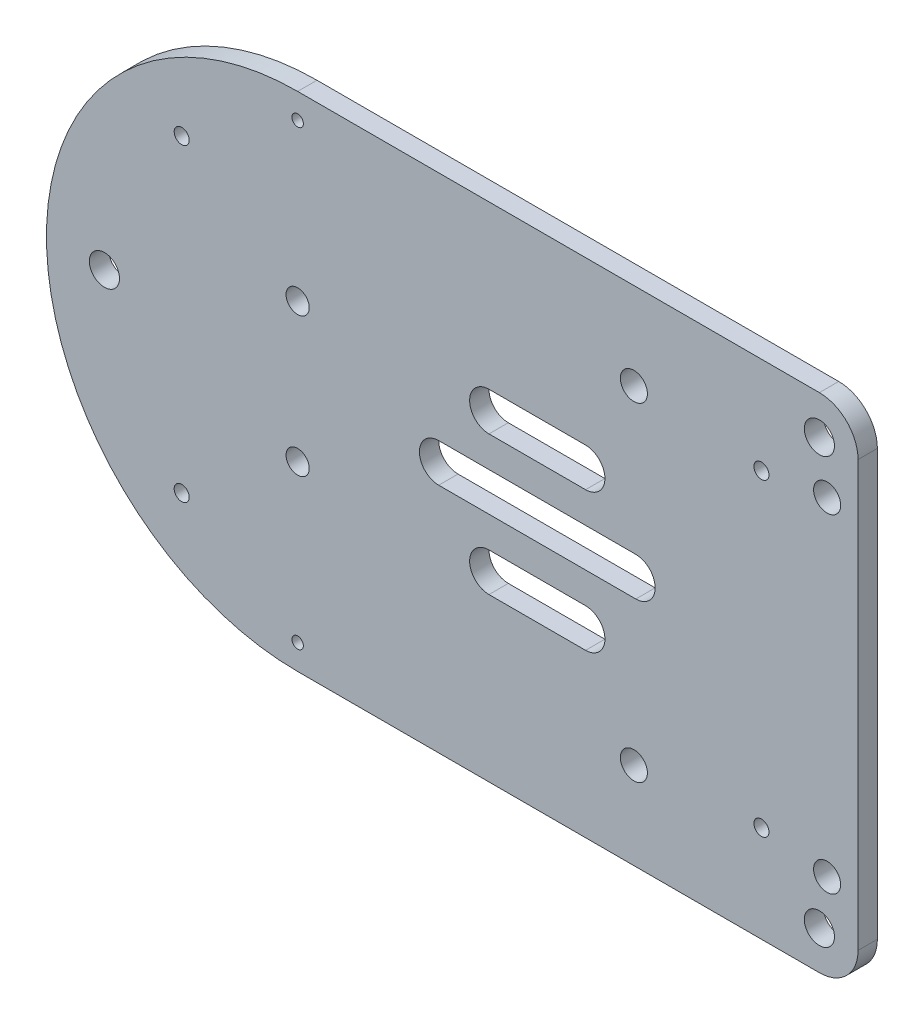
ISO-10303-21;
HEADER;
FILE_DESCRIPTION(('STEP AP214'),'2;1');
FILE_NAME('part.step','',(''),(''),'','','');
FILE_SCHEMA(('AUTOMOTIVE_DESIGN { 1 0 10303 214 1 1 1 1 }'));
ENDSEC;
DATA;
#1=APPLICATION_CONTEXT('core data for automotive mechanical design processes');
#2=APPLICATION_PROTOCOL_DEFINITION('international standard','automotive_design',2000,#1);
#3=PRODUCT_CONTEXT('',#1,'mechanical');
#4=PRODUCT('Part','Part','',(#3));
#5=PRODUCT_RELATED_PRODUCT_CATEGORY('part','',(#4));
#6=PRODUCT_DEFINITION_FORMATION('','',#4);
#7=PRODUCT_DEFINITION_CONTEXT('part definition',#1,'design');
#8=PRODUCT_DEFINITION('design','',#6,#7);
#9=PRODUCT_DEFINITION_SHAPE('','',#8);
#10=(LENGTH_UNIT() NAMED_UNIT(*) SI_UNIT(.MILLI.,.METRE.));
#11=(NAMED_UNIT(*) PLANE_ANGLE_UNIT() SI_UNIT($,.RADIAN.));
#12=(NAMED_UNIT(*) SI_UNIT($,.STERADIAN.) SOLID_ANGLE_UNIT());
#13=UNCERTAINTY_MEASURE_WITH_UNIT(LENGTH_MEASURE(1.E-05),#10,'distance_accuracy_value','');
#14=(GEOMETRIC_REPRESENTATION_CONTEXT(3) GLOBAL_UNCERTAINTY_ASSIGNED_CONTEXT((#13)) GLOBAL_UNIT_ASSIGNED_CONTEXT((#10,
#11,#12)) REPRESENTATION_CONTEXT('',''));
#15=CARTESIAN_POINT('',(0.,0.,0.));
#16=DIRECTION('',(0.,0.,1.));
#17=DIRECTION('',(1.,0.,0.));
#18=AXIS2_PLACEMENT_3D('',#15,#16,#17);
#19=CARTESIAN_POINT('',(-40.,0.,5.));
#20=DIRECTION('',(0.,0.,1.));
#21=DIRECTION('',(1.,0.,0.));
#22=AXIS2_PLACEMENT_3D('',#19,#20,#21);
#23=PLANE('',#22);
#24=CARTESIAN_POINT('',(-40.,58.5,5.));
#25=DIRECTION('',(0.,0.,1.));
#26=DIRECTION('',(1.,0.,0.));
#27=AXIS2_PLACEMENT_3D('',#24,#25,#26);
#28=CIRCLE('',#27,1.475);
#29=CARTESIAN_POINT('',(-38.525,58.5,5.));
#30=VERTEX_POINT('',#29);
#31=EDGE_CURVE('E186',#30,#30,#28,.T.);
#32=ORIENTED_EDGE('',*,*,#31,.F.);
#33=EDGE_LOOP('',(#32));
#34=FACE_BOUND('',#33,.T.);
#35=CARTESIAN_POINT('',(97.,-42.5,5.));
#36=DIRECTION('',(0.,0.,1.));
#37=DIRECTION('',(-1.,0.,0.));
#38=AXIS2_PLACEMENT_3D('',#35,#36,#37);
#39=CIRCLE('',#38,3.50000000000001);
#40=CARTESIAN_POINT('',(93.5,-42.5,5.));
#41=VERTEX_POINT('',#40);
#42=EDGE_CURVE('E233',#41,#41,#39,.T.);
#43=ORIENTED_EDGE('',*,*,#42,.F.);
#44=EDGE_LOOP('',(#43));
#45=FACE_BOUND('',#44,.T.);
#46=CARTESIAN_POINT('',(47.,42.5,5.));
#47=DIRECTION('',(0.,0.,1.));
#48=DIRECTION('',(1.,0.,0.));
#49=AXIS2_PLACEMENT_3D('',#46,#47,#48);
#50=CIRCLE('',#49,3.5);
#51=CARTESIAN_POINT('',(50.5,42.5,5.));
#52=VERTEX_POINT('',#51);
#53=EDGE_CURVE('E276',#52,#52,#50,.T.);
#54=ORIENTED_EDGE('',*,*,#53,.F.);
#55=EDGE_LOOP('',(#54));
#56=FACE_BOUND('',#55,.T.);
#57=CARTESIAN_POINT('',(-70.,40.,5.));
#58=DIRECTION('',(0.,0.,1.));
#59=DIRECTION('',(1.,0.,0.));
#60=AXIS2_PLACEMENT_3D('',#57,#58,#59);
#61=CIRCLE('',#60,1.95);
#62=CARTESIAN_POINT('',(-68.05,40.,5.));
#63=VERTEX_POINT('',#62);
#64=EDGE_CURVE('E288',#63,#63,#61,.T.);
#65=ORIENTED_EDGE('',*,*,#64,.F.);
#66=EDGE_LOOP('',(#65));
#67=FACE_BOUND('',#66,.T.);
#68=CARTESIAN_POINT('',(80.,40.,5.));
#69=DIRECTION('',(0.,0.,1.));
#70=DIRECTION('',(1.,0.,0.));
#71=AXIS2_PLACEMENT_3D('',#68,#69,#70);
#72=CIRCLE('',#71,1.95);
#73=CARTESIAN_POINT('',(81.95,40.,5.));
#74=VERTEX_POINT('',#73);
#75=EDGE_CURVE('E300',#74,#74,#72,.T.);
#76=ORIENTED_EDGE('',*,*,#75,.F.);
#77=EDGE_LOOP('',(#76));
#78=FACE_BOUND('',#77,.T.);
#79=CARTESIAN_POINT('',(-40.,18.,5.));
#80=DIRECTION('',(0.,0.,1.));
#81=DIRECTION('',(1.,0.,0.));
#82=AXIS2_PLACEMENT_3D('',#79,#80,#81);
#83=CIRCLE('',#82,3.);
#84=CARTESIAN_POINT('',(-37.,18.,5.));
#85=VERTEX_POINT('',#84);
#86=EDGE_CURVE('E312',#85,#85,#83,.T.);
#87=ORIENTED_EDGE('',*,*,#86,.F.);
#88=EDGE_LOOP('',(#87));
#89=FACE_BOUND('',#88,.T.);
#90=CARTESIAN_POINT('',(95.,55.,5.));
#91=DIRECTION('',(0.,0.,1.));
#92=DIRECTION('',(1.,0.,0.));
#93=AXIS2_PLACEMENT_3D('',#90,#91,#92);
#94=CIRCLE('',#93,3.9);
#95=CARTESIAN_POINT('',(98.9,55.,5.));
#96=VERTEX_POINT('',#95);
#97=EDGE_CURVE('E324',#96,#96,#94,.T.);
#98=ORIENTED_EDGE('',*,*,#97,.F.);
#99=EDGE_LOOP('',(#98));
#100=FACE_BOUND('',#99,.T.);
#101=CARTESIAN_POINT('',(-40.,0.,5.));
#102=DIRECTION('',(0.,0.,1.));
#103=DIRECTION('',(1.,0.,0.));
#104=AXIS2_PLACEMENT_3D('',#101,#102,#103);
#105=CIRCLE('',#104,65.);
#106=CARTESIAN_POINT('',(-40.,65.,5.));
#107=VERTEX_POINT('',#106);
#108=CARTESIAN_POINT('',(-40.,-65.,5.));
#109=VERTEX_POINT('',#108);
#110=EDGE_CURVE('E336',#107,#109,#105,.T.);
#111=ORIENTED_EDGE('',*,*,#110,.T.);
#112=DIRECTION('',(1.,0.,0.));
#113=VECTOR('',#112,1.);
#114=CARTESIAN_POINT('',(-40.,-65.,5.));
#115=LINE('',#114,#113);
#116=CARTESIAN_POINT('',(94.9999999999999,-65.,5.));
#117=VERTEX_POINT('',#116);
#118=EDGE_CURVE('E339',#109,#117,#115,.T.);
#119=ORIENTED_EDGE('',*,*,#118,.T.);
#120=CARTESIAN_POINT('',(95.,-55.,5.));
#121=DIRECTION('',(0.,0.,1.));
#122=DIRECTION('',(1.,0.,0.));
#123=AXIS2_PLACEMENT_3D('',#120,#121,#122);
#124=CIRCLE('',#123,10.);
#125=CARTESIAN_POINT('',(105.,-54.9999999999999,5.));
#126=VERTEX_POINT('',#125);
#127=EDGE_CURVE('E342',#117,#126,#124,.T.);
#128=ORIENTED_EDGE('',*,*,#127,.T.);
#129=DIRECTION('',(0.,1.,0.));
#130=VECTOR('',#129,1.);
#131=CARTESIAN_POINT('',(105.,54.9999999999999,5.));
#132=LINE('',#131,#130);
#133=CARTESIAN_POINT('',(105.,54.9999999999999,5.));
#134=VERTEX_POINT('',#133);
#135=EDGE_CURVE('E344',#126,#134,#132,.T.);
#136=ORIENTED_EDGE('',*,*,#135,.T.);
#137=CARTESIAN_POINT('',(95.,55.,5.));
#138=DIRECTION('',(0.,0.,1.));
#139=DIRECTION('',(-1.,0.,0.));
#140=AXIS2_PLACEMENT_3D('',#137,#138,#139);
#141=CIRCLE('',#140,10.);
#142=CARTESIAN_POINT('',(94.9999999999999,65.,5.));
#143=VERTEX_POINT('',#142);
#144=EDGE_CURVE('E346',#134,#143,#141,.T.);
#145=ORIENTED_EDGE('',*,*,#144,.T.);
#146=DIRECTION('',(-1.,0.,0.));
#147=VECTOR('',#146,1.);
#148=CARTESIAN_POINT('',(-40.,65.,5.));
#149=LINE('',#148,#147);
#150=EDGE_CURVE('E348',#143,#107,#149,.T.);
#151=ORIENTED_EDGE('',*,*,#150,.T.);
#152=EDGE_LOOP('',(#111,#119,#128,#136,#145,#151));
#153=FACE_BOUND('',#152,.T.);
#154=CARTESIAN_POINT('',(-90.,0.,5.));
#155=DIRECTION('',(0.,0.,1.));
#156=DIRECTION('',(1.,0.,0.));
#157=AXIS2_PLACEMENT_3D('',#154,#155,#156);
#158=CIRCLE('',#157,3.9);
#159=CARTESIAN_POINT('',(-86.1,0.,5.));
#160=VERTEX_POINT('',#159);
#161=EDGE_CURVE('E330',#160,#160,#158,.T.);
#162=ORIENTED_EDGE('',*,*,#161,.F.);
#163=EDGE_LOOP('',(#162));
#164=FACE_BOUND('',#163,.T.);
#165=CARTESIAN_POINT('',(95.,-55.,5.));
#166=DIRECTION('',(0.,0.,1.));
#167=DIRECTION('',(-1.,0.,0.));
#168=AXIS2_PLACEMENT_3D('',#165,#166,#167);
#169=CIRCLE('',#168,3.9);
#170=CARTESIAN_POINT('',(91.1,-55.,5.));
#171=VERTEX_POINT('',#170);
#172=EDGE_CURVE('E318',#171,#171,#169,.T.);
#173=ORIENTED_EDGE('',*,*,#172,.F.);
#174=EDGE_LOOP('',(#173));
#175=FACE_BOUND('',#174,.T.);
#176=CARTESIAN_POINT('',(-40.,-18.,5.));
#177=DIRECTION('',(0.,0.,1.));
#178=DIRECTION('',(-1.,0.,0.));
#179=AXIS2_PLACEMENT_3D('',#176,#177,#178);
#180=CIRCLE('',#179,3.);
#181=CARTESIAN_POINT('',(-43.,-18.,5.));
#182=VERTEX_POINT('',#181);
#183=EDGE_CURVE('E306',#182,#182,#180,.T.);
#184=ORIENTED_EDGE('',*,*,#183,.F.);
#185=EDGE_LOOP('',(#184));
#186=FACE_BOUND('',#185,.T.);
#187=CARTESIAN_POINT('',(80.,-40.,5.));
#188=DIRECTION('',(0.,0.,1.));
#189=DIRECTION('',(-1.,0.,0.));
#190=AXIS2_PLACEMENT_3D('',#187,#188,#189);
#191=CIRCLE('',#190,1.95);
#192=CARTESIAN_POINT('',(78.05,-40.,5.));
#193=VERTEX_POINT('',#192);
#194=EDGE_CURVE('E294',#193,#193,#191,.T.);
#195=ORIENTED_EDGE('',*,*,#194,.F.);
#196=EDGE_LOOP('',(#195));
#197=FACE_BOUND('',#196,.T.);
#198=CARTESIAN_POINT('',(-70.,-40.,5.));
#199=DIRECTION('',(0.,0.,1.));
#200=DIRECTION('',(-1.,0.,0.));
#201=AXIS2_PLACEMENT_3D('',#198,#199,#200);
#202=CIRCLE('',#201,1.95);
#203=CARTESIAN_POINT('',(-71.95,-40.,5.));
#204=VERTEX_POINT('',#203);
#205=EDGE_CURVE('E282',#204,#204,#202,.T.);
#206=ORIENTED_EDGE('',*,*,#205,.F.);
#207=EDGE_LOOP('',(#206));
#208=FACE_BOUND('',#207,.T.);
#209=CARTESIAN_POINT('',(97.,42.5,5.));
#210=DIRECTION('',(0.,0.,1.));
#211=DIRECTION('',(1.,0.,0.));
#212=AXIS2_PLACEMENT_3D('',#209,#210,#211);
#213=CIRCLE('',#212,3.50000000000001);
#214=CARTESIAN_POINT('',(100.5,42.5,5.));
#215=VERTEX_POINT('',#214);
#216=EDGE_CURVE('E270',#215,#215,#213,.T.);
#217=ORIENTED_EDGE('',*,*,#216,.F.);
#218=EDGE_LOOP('',(#217));
#219=FACE_BOUND('',#218,.T.);
#220=DIRECTION('',(1.,0.,0.));
#221=VECTOR('',#220,1.);
#222=CARTESIAN_POINT('',(-3.49999999999998,-5.,5.));
#223=LINE('',#222,#221);
#224=CARTESIAN_POINT('',(-3.49999999999998,-5.,5.));
#225=VERTEX_POINT('',#224);
#226=CARTESIAN_POINT('',(47.5,-5.,5.));
#227=VERTEX_POINT('',#226);
#228=EDGE_CURVE('E241',#225,#227,#223,.T.);
#229=ORIENTED_EDGE('',*,*,#228,.F.);
#230=CARTESIAN_POINT('',(-3.49999999999998,0.,5.));
#231=DIRECTION('',(0.,0.,1.));
#232=DIRECTION('',(1.,0.,0.));
#233=AXIS2_PLACEMENT_3D('',#230,#231,#232);
#234=CIRCLE('',#233,5.);
#235=CARTESIAN_POINT('',(-3.49999999999998,5.,5.));
#236=VERTEX_POINT('',#235);
#237=EDGE_CURVE('E239',#236,#225,#234,.T.);
#238=ORIENTED_EDGE('',*,*,#237,.F.);
#239=DIRECTION('',(-1.,0.,0.));
#240=VECTOR('',#239,1.);
#241=CARTESIAN_POINT('',(-3.49999999999998,5.,5.));
#242=LINE('',#241,#240);
#243=CARTESIAN_POINT('',(47.5,5.,5.));
#244=VERTEX_POINT('',#243);
#245=EDGE_CURVE('E247',#244,#236,#242,.T.);
#246=ORIENTED_EDGE('',*,*,#245,.F.);
#247=CARTESIAN_POINT('',(47.5,0.,5.));
#248=DIRECTION('',(0.,0.,1.));
#249=DIRECTION('',(1.,0.,0.));
#250=AXIS2_PLACEMENT_3D('',#247,#248,#249);
#251=CIRCLE('',#250,5.);
#252=EDGE_CURVE('E244',#227,#244,#251,.T.);
#253=ORIENTED_EDGE('',*,*,#252,.F.);
#254=EDGE_LOOP('',(#229,#238,#246,#253));
#255=FACE_BOUND('',#254,.T.);
#256=CARTESIAN_POINT('',(47.,-42.5,5.));
#257=DIRECTION('',(0.,0.,1.));
#258=DIRECTION('',(-1.,0.,0.));
#259=AXIS2_PLACEMENT_3D('',#256,#257,#258);
#260=CIRCLE('',#259,3.5);
#261=CARTESIAN_POINT('',(43.5,-42.5,5.));
#262=VERTEX_POINT('',#261);
#263=EDGE_CURVE('E227',#262,#262,#260,.T.);
#264=ORIENTED_EDGE('',*,*,#263,.F.);
#265=EDGE_LOOP('',(#264));
#266=FACE_BOUND('',#265,.T.);
#267=DIRECTION('',(1.,0.,0.));
#268=VECTOR('',#267,1.);
#269=CARTESIAN_POINT('',(9.50000000000002,13.,5.));
#270=LINE('',#269,#268);
#271=CARTESIAN_POINT('',(9.50000000000002,13.,5.));
#272=VERTEX_POINT('',#271);
#273=CARTESIAN_POINT('',(34.5,13.,5.));
#274=VERTEX_POINT('',#273);
#275=EDGE_CURVE('E198',#272,#274,#270,.T.);
#276=ORIENTED_EDGE('',*,*,#275,.F.);
#277=CARTESIAN_POINT('',(9.50000000000002,18.,5.));
#278=DIRECTION('',(0.,0.,1.));
#279=DIRECTION('',(1.,0.,0.));
#280=AXIS2_PLACEMENT_3D('',#277,#278,#279);
#281=CIRCLE('',#280,5.);
#282=CARTESIAN_POINT('',(9.50000000000002,23.,5.));
#283=VERTEX_POINT('',#282);
#284=EDGE_CURVE('E196',#283,#272,#281,.T.);
#285=ORIENTED_EDGE('',*,*,#284,.F.);
#286=DIRECTION('',(-1.,0.,0.));
#287=VECTOR('',#286,1.);
#288=CARTESIAN_POINT('',(9.50000000000002,23.,5.));
#289=LINE('',#288,#287);
#290=CARTESIAN_POINT('',(34.5,23.,5.));
#291=VERTEX_POINT('',#290);
#292=EDGE_CURVE('E204',#291,#283,#289,.T.);
#293=ORIENTED_EDGE('',*,*,#292,.F.);
#294=CARTESIAN_POINT('',(34.5,18.,5.));
#295=DIRECTION('',(0.,0.,1.));
#296=DIRECTION('',(1.,0.,0.));
#297=AXIS2_PLACEMENT_3D('',#294,#295,#296);
#298=CIRCLE('',#297,5.);
#299=EDGE_CURVE('E201',#274,#291,#298,.T.);
#300=ORIENTED_EDGE('',*,*,#299,.F.);
#301=EDGE_LOOP('',(#276,#285,#293,#300));
#302=FACE_BOUND('',#301,.T.);
#303=DIRECTION('',(1.,0.,0.));
#304=VECTOR('',#303,1.);
#305=CARTESIAN_POINT('',(9.50000000000002,-23.,5.));
#306=LINE('',#305,#304);
#307=CARTESIAN_POINT('',(9.50000000000002,-23.,5.));
#308=VERTEX_POINT('',#307);
#309=CARTESIAN_POINT('',(34.5,-23.,5.));
#310=VERTEX_POINT('',#309);
#311=EDGE_CURVE('E165',#308,#310,#306,.T.);
#312=ORIENTED_EDGE('',*,*,#311,.F.);
#313=CARTESIAN_POINT('',(9.50000000000002,-18.,5.));
#314=DIRECTION('',(0.,0.,1.));
#315=DIRECTION('',(-1.,0.,0.));
#316=AXIS2_PLACEMENT_3D('',#313,#314,#315);
#317=CIRCLE('',#316,5.);
#318=CARTESIAN_POINT('',(9.50000000000002,-13.,5.));
#319=VERTEX_POINT('',#318);
#320=EDGE_CURVE('E157',#319,#308,#317,.T.);
#321=ORIENTED_EDGE('',*,*,#320,.F.);
#322=DIRECTION('',(-1.,0.,0.));
#323=VECTOR('',#322,1.);
#324=CARTESIAN_POINT('',(9.50000000000002,-13.,5.));
#325=LINE('',#324,#323);
#326=CARTESIAN_POINT('',(34.5,-13.,5.));
#327=VERTEX_POINT('',#326);
#328=EDGE_CURVE('E180',#327,#319,#325,.T.);
#329=ORIENTED_EDGE('',*,*,#328,.F.);
#330=CARTESIAN_POINT('',(34.5,-18.,5.));
#331=DIRECTION('',(0.,0.,1.));
#332=DIRECTION('',(-1.,0.,0.));
#333=AXIS2_PLACEMENT_3D('',#330,#331,#332);
#334=CIRCLE('',#333,5.);
#335=EDGE_CURVE('E178',#310,#327,#334,.T.);
#336=ORIENTED_EDGE('',*,*,#335,.F.);
#337=EDGE_LOOP('',(#312,#321,#329,#336));
#338=FACE_BOUND('',#337,.T.);
#339=CARTESIAN_POINT('',(-40.,-58.5,5.));
#340=DIRECTION('',(0.,0.,1.));
#341=DIRECTION('',(-1.,0.,0.));
#342=AXIS2_PLACEMENT_3D('',#339,#340,#341);
#343=CIRCLE('',#342,1.475);
#344=CARTESIAN_POINT('',(-41.475,-58.5,5.));
#345=VERTEX_POINT('',#344);
#346=EDGE_CURVE('E529',#345,#345,#343,.T.);
#347=ORIENTED_EDGE('',*,*,#346,.F.);
#348=EDGE_LOOP('',(#347));
#349=FACE_BOUND('',#348,.T.);
#350=ADVANCED_FACE('F32',(#34,#45,#56,#67,#78,#89,#100,#153,#164,#175,#186,#197,#208,#219,#255,
#266,#302,#338,#349),#23,.T.);
#351=CARTESIAN_POINT('',(-40.,0.,0.));
#352=DIRECTION('',(0.,0.,1.));
#353=DIRECTION('',(1.,0.,0.));
#354=AXIS2_PLACEMENT_3D('',#351,#352,#353);
#355=PLANE('',#354);
#356=CARTESIAN_POINT('',(9.50000000000002,18.,0.));
#357=DIRECTION('',(0.,0.,1.));
#358=DIRECTION('',(1.,0.,0.));
#359=AXIS2_PLACEMENT_3D('',#356,#357,#358);
#360=CIRCLE('',#359,5.);
#361=CARTESIAN_POINT('',(9.50000000000002,23.,0.));
#362=VERTEX_POINT('',#361);
#363=CARTESIAN_POINT('',(9.50000000000002,13.,0.));
#364=VERTEX_POINT('',#363);
#365=EDGE_CURVE('E173',#362,#364,#360,.T.);
#366=ORIENTED_EDGE('',*,*,#365,.T.);
#367=DIRECTION('',(1.,0.,0.));
#368=VECTOR('',#367,1.);
#369=CARTESIAN_POINT('',(9.50000000000002,13.,0.));
#370=LINE('',#369,#368);
#371=CARTESIAN_POINT('',(34.5,13.,0.));
#372=VERTEX_POINT('',#371);
#373=EDGE_CURVE('E209',#364,#372,#370,.T.);
#374=ORIENTED_EDGE('',*,*,#373,.T.);
#375=CARTESIAN_POINT('',(34.5,18.,0.));
#376=DIRECTION('',(0.,0.,1.));
#377=DIRECTION('',(1.,0.,0.));
#378=AXIS2_PLACEMENT_3D('',#375,#376,#377);
#379=CIRCLE('',#378,5.);
#380=CARTESIAN_POINT('',(34.5,23.,0.));
#381=VERTEX_POINT('',#380);
#382=EDGE_CURVE('E212',#372,#381,#379,.T.);
#383=ORIENTED_EDGE('',*,*,#382,.T.);
#384=DIRECTION('',(-1.,0.,0.));
#385=VECTOR('',#384,1.);
#386=CARTESIAN_POINT('',(9.50000000000002,23.,0.));
#387=LINE('',#386,#385);
#388=EDGE_CURVE('E199',#381,#362,#387,.T.);
#389=ORIENTED_EDGE('',*,*,#388,.T.);
#390=EDGE_LOOP('',(#366,#374,#383,#389));
#391=FACE_BOUND('',#390,.T.);
#392=CARTESIAN_POINT('',(97.,42.5,0.));
#393=DIRECTION('',(0.,0.,1.));
#394=DIRECTION('',(1.,0.,0.));
#395=AXIS2_PLACEMENT_3D('',#392,#393,#394);
#396=CIRCLE('',#395,3.50000000000001);
#397=CARTESIAN_POINT('',(100.5,42.5,0.));
#398=VERTEX_POINT('',#397);
#399=EDGE_CURVE('E269',#398,#398,#396,.T.);
#400=ORIENTED_EDGE('',*,*,#399,.T.);
#401=EDGE_LOOP('',(#400));
#402=FACE_BOUND('',#401,.T.);
#403=CARTESIAN_POINT('',(47.,42.5,0.));
#404=DIRECTION('',(0.,0.,1.));
#405=DIRECTION('',(1.,0.,0.));
#406=AXIS2_PLACEMENT_3D('',#403,#404,#405);
#407=CIRCLE('',#406,3.5);
#408=CARTESIAN_POINT('',(50.5,42.5,0.));
#409=VERTEX_POINT('',#408);
#410=EDGE_CURVE('E273',#409,#409,#407,.T.);
#411=ORIENTED_EDGE('',*,*,#410,.T.);
#412=EDGE_LOOP('',(#411));
#413=FACE_BOUND('',#412,.T.);
#414=CARTESIAN_POINT('',(-70.,-40.,0.));
#415=DIRECTION('',(0.,0.,1.));
#416=DIRECTION('',(-1.,0.,0.));
#417=AXIS2_PLACEMENT_3D('',#414,#415,#416);
#418=CIRCLE('',#417,1.95);
#419=CARTESIAN_POINT('',(-71.95,-40.,0.));
#420=VERTEX_POINT('',#419);
#421=EDGE_CURVE('E279',#420,#420,#418,.T.);
#422=ORIENTED_EDGE('',*,*,#421,.T.);
#423=EDGE_LOOP('',(#422));
#424=FACE_BOUND('',#423,.T.);
#425=CARTESIAN_POINT('',(-70.,40.,0.));
#426=DIRECTION('',(0.,0.,1.));
#427=DIRECTION('',(1.,0.,0.));
#428=AXIS2_PLACEMENT_3D('',#425,#426,#427);
#429=CIRCLE('',#428,1.95);
#430=CARTESIAN_POINT('',(-68.05,40.,0.));
#431=VERTEX_POINT('',#430);
#432=EDGE_CURVE('E285',#431,#431,#429,.T.);
#433=ORIENTED_EDGE('',*,*,#432,.T.);
#434=EDGE_LOOP('',(#433));
#435=FACE_BOUND('',#434,.T.);
#436=CARTESIAN_POINT('',(80.,-40.,0.));
#437=DIRECTION('',(0.,0.,1.));
#438=DIRECTION('',(-1.,0.,0.));
#439=AXIS2_PLACEMENT_3D('',#436,#437,#438);
#440=CIRCLE('',#439,1.95);
#441=CARTESIAN_POINT('',(78.05,-40.,0.));
#442=VERTEX_POINT('',#441);
#443=EDGE_CURVE('E291',#442,#442,#440,.T.);
#444=ORIENTED_EDGE('',*,*,#443,.T.);
#445=EDGE_LOOP('',(#444));
#446=FACE_BOUND('',#445,.T.);
#447=CARTESIAN_POINT('',(80.,40.,0.));
#448=DIRECTION('',(0.,0.,1.));
#449=DIRECTION('',(1.,0.,0.));
#450=AXIS2_PLACEMENT_3D('',#447,#448,#449);
#451=CIRCLE('',#450,1.95);
#452=CARTESIAN_POINT('',(81.95,40.,0.));
#453=VERTEX_POINT('',#452);
#454=EDGE_CURVE('E297',#453,#453,#451,.T.);
#455=ORIENTED_EDGE('',*,*,#454,.T.);
#456=EDGE_LOOP('',(#455));
#457=FACE_BOUND('',#456,.T.);
#458=CARTESIAN_POINT('',(-40.,-18.,0.));
#459=DIRECTION('',(0.,0.,1.));
#460=DIRECTION('',(-1.,0.,0.));
#461=AXIS2_PLACEMENT_3D('',#458,#459,#460);
#462=CIRCLE('',#461,3.);
#463=CARTESIAN_POINT('',(-43.,-18.,0.));
#464=VERTEX_POINT('',#463);
#465=EDGE_CURVE('E303',#464,#464,#462,.T.);
#466=ORIENTED_EDGE('',*,*,#465,.T.);
#467=EDGE_LOOP('',(#466));
#468=FACE_BOUND('',#467,.T.);
#469=CARTESIAN_POINT('',(-40.,18.,0.));
#470=DIRECTION('',(0.,0.,1.));
#471=DIRECTION('',(1.,0.,0.));
#472=AXIS2_PLACEMENT_3D('',#469,#470,#471);
#473=CIRCLE('',#472,3.);
#474=CARTESIAN_POINT('',(-37.,18.,0.));
#475=VERTEX_POINT('',#474);
#476=EDGE_CURVE('E309',#475,#475,#473,.T.);
#477=ORIENTED_EDGE('',*,*,#476,.T.);
#478=EDGE_LOOP('',(#477));
#479=FACE_BOUND('',#478,.T.);
#480=CARTESIAN_POINT('',(95.,-55.,0.));
#481=DIRECTION('',(0.,0.,1.));
#482=DIRECTION('',(-1.,0.,0.));
#483=AXIS2_PLACEMENT_3D('',#480,#481,#482);
#484=CIRCLE('',#483,3.9);
#485=CARTESIAN_POINT('',(91.1,-55.,0.));
#486=VERTEX_POINT('',#485);
#487=EDGE_CURVE('E315',#486,#486,#484,.T.);
#488=ORIENTED_EDGE('',*,*,#487,.T.);
#489=EDGE_LOOP('',(#488));
#490=FACE_BOUND('',#489,.T.);
#491=CARTESIAN_POINT('',(95.,55.,0.));
#492=DIRECTION('',(0.,0.,1.));
#493=DIRECTION('',(1.,0.,0.));
#494=AXIS2_PLACEMENT_3D('',#491,#492,#493);
#495=CIRCLE('',#494,3.9);
#496=CARTESIAN_POINT('',(98.9,55.,0.));
#497=VERTEX_POINT('',#496);
#498=EDGE_CURVE('E321',#497,#497,#495,.T.);
#499=ORIENTED_EDGE('',*,*,#498,.T.);
#500=EDGE_LOOP('',(#499));
#501=FACE_BOUND('',#500,.T.);
#502=CARTESIAN_POINT('',(-90.,0.,0.));
#503=DIRECTION('',(0.,0.,1.));
#504=DIRECTION('',(1.,0.,0.));
#505=AXIS2_PLACEMENT_3D('',#502,#503,#504);
#506=CIRCLE('',#505,3.9);
#507=CARTESIAN_POINT('',(-86.1,0.,0.));
#508=VERTEX_POINT('',#507);
#509=EDGE_CURVE('E327',#508,#508,#506,.T.);
#510=ORIENTED_EDGE('',*,*,#509,.T.);
#511=EDGE_LOOP('',(#510));
#512=FACE_BOUND('',#511,.T.);
#513=CARTESIAN_POINT('',(-40.,0.,0.));
#514=DIRECTION('',(0.,0.,1.));
#515=DIRECTION('',(1.,0.,0.));
#516=AXIS2_PLACEMENT_3D('',#513,#514,#515);
#517=CIRCLE('',#516,65.);
#518=CARTESIAN_POINT('',(-40.,65.,0.));
#519=VERTEX_POINT('',#518);
#520=CARTESIAN_POINT('',(-40.,-65.,0.));
#521=VERTEX_POINT('',#520);
#522=EDGE_CURVE('E333',#519,#521,#517,.T.);
#523=ORIENTED_EDGE('',*,*,#522,.F.);
#524=DIRECTION('',(-1.,0.,0.));
#525=VECTOR('',#524,1.);
#526=CARTESIAN_POINT('',(-40.,65.,0.));
#527=LINE('',#526,#525);
#528=CARTESIAN_POINT('',(94.9999999999999,65.,0.));
#529=VERTEX_POINT('',#528);
#530=EDGE_CURVE('E340',#529,#519,#527,.T.);
#531=ORIENTED_EDGE('',*,*,#530,.F.);
#532=CARTESIAN_POINT('',(95.,55.,0.));
#533=DIRECTION('',(0.,0.,1.));
#534=DIRECTION('',(-1.,0.,0.));
#535=AXIS2_PLACEMENT_3D('',#532,#533,#534);
#536=CIRCLE('',#535,10.);
#537=CARTESIAN_POINT('',(105.,54.9999999999999,0.));
#538=VERTEX_POINT('',#537);
#539=EDGE_CURVE('E359',#538,#529,#536,.T.);
#540=ORIENTED_EDGE('',*,*,#539,.F.);
#541=DIRECTION('',(0.,1.,0.));
#542=VECTOR('',#541,1.);
#543=CARTESIAN_POINT('',(105.,54.9999999999999,0.));
#544=LINE('',#543,#542);
#545=CARTESIAN_POINT('',(105.,-54.9999999999999,0.));
#546=VERTEX_POINT('',#545);
#547=EDGE_CURVE('E357',#546,#538,#544,.T.);
#548=ORIENTED_EDGE('',*,*,#547,.F.);
#549=CARTESIAN_POINT('',(95.,-55.,0.));
#550=DIRECTION('',(0.,0.,1.));
#551=DIRECTION('',(1.,0.,0.));
#552=AXIS2_PLACEMENT_3D('',#549,#550,#551);
#553=CIRCLE('',#552,10.);
#554=CARTESIAN_POINT('',(94.9999999999999,-65.,0.));
#555=VERTEX_POINT('',#554);
#556=EDGE_CURVE('E355',#555,#546,#553,.T.);
#557=ORIENTED_EDGE('',*,*,#556,.F.);
#558=DIRECTION('',(1.,0.,0.));
#559=VECTOR('',#558,1.);
#560=CARTESIAN_POINT('',(-40.,-65.,0.));
#561=LINE('',#560,#559);
#562=EDGE_CURVE('E353',#521,#555,#561,.T.);
#563=ORIENTED_EDGE('',*,*,#562,.F.);
#564=EDGE_LOOP('',(#523,#531,#540,#548,#557,#563));
#565=FACE_BOUND('',#564,.T.);
#566=CARTESIAN_POINT('',(-3.49999999999998,0.,0.));
#567=DIRECTION('',(0.,0.,1.));
#568=DIRECTION('',(1.,0.,0.));
#569=AXIS2_PLACEMENT_3D('',#566,#567,#568);
#570=CIRCLE('',#569,5.);
#571=CARTESIAN_POINT('',(-3.49999999999998,5.,0.));
#572=VERTEX_POINT('',#571);
#573=CARTESIAN_POINT('',(-3.49999999999998,-5.,0.));
#574=VERTEX_POINT('',#573);
#575=EDGE_CURVE('E236',#572,#574,#570,.T.);
#576=ORIENTED_EDGE('',*,*,#575,.T.);
#577=DIRECTION('',(1.,0.,0.));
#578=VECTOR('',#577,1.);
#579=CARTESIAN_POINT('',(-3.49999999999998,-5.,0.));
#580=LINE('',#579,#578);
#581=CARTESIAN_POINT('',(47.5,-5.,0.));
#582=VERTEX_POINT('',#581);
#583=EDGE_CURVE('E252',#574,#582,#580,.T.);
#584=ORIENTED_EDGE('',*,*,#583,.T.);
#585=CARTESIAN_POINT('',(47.5,0.,0.));
#586=DIRECTION('',(0.,0.,1.));
#587=DIRECTION('',(1.,0.,0.));
#588=AXIS2_PLACEMENT_3D('',#585,#586,#587);
#589=CIRCLE('',#588,5.);
#590=CARTESIAN_POINT('',(47.5,5.,0.));
#591=VERTEX_POINT('',#590);
#592=EDGE_CURVE('E255',#582,#591,#589,.T.);
#593=ORIENTED_EDGE('',*,*,#592,.T.);
#594=DIRECTION('',(-1.,0.,0.));
#595=VECTOR('',#594,1.);
#596=CARTESIAN_POINT('',(-3.49999999999998,5.,0.));
#597=LINE('',#596,#595);
#598=EDGE_CURVE('E242',#591,#572,#597,.T.);
#599=ORIENTED_EDGE('',*,*,#598,.T.);
#600=EDGE_LOOP('',(#576,#584,#593,#599));
#601=FACE_BOUND('',#600,.T.);
#602=CARTESIAN_POINT('',(97.,-42.5,0.));
#603=DIRECTION('',(0.,0.,1.));
#604=DIRECTION('',(-1.,0.,0.));
#605=AXIS2_PLACEMENT_3D('',#602,#603,#604);
#606=CIRCLE('',#605,3.50000000000001);
#607=CARTESIAN_POINT('',(93.5,-42.5,0.));
#608=VERTEX_POINT('',#607);
#609=EDGE_CURVE('E230',#608,#608,#606,.T.);
#610=ORIENTED_EDGE('',*,*,#609,.T.);
#611=EDGE_LOOP('',(#610));
#612=FACE_BOUND('',#611,.T.);
#613=CARTESIAN_POINT('',(47.,-42.5,0.));
#614=DIRECTION('',(0.,0.,1.));
#615=DIRECTION('',(-1.,0.,0.));
#616=AXIS2_PLACEMENT_3D('',#613,#614,#615);
#617=CIRCLE('',#616,3.5);
#618=CARTESIAN_POINT('',(43.5,-42.5,0.));
#619=VERTEX_POINT('',#618);
#620=EDGE_CURVE('E226',#619,#619,#617,.T.);
#621=ORIENTED_EDGE('',*,*,#620,.T.);
#622=EDGE_LOOP('',(#621));
#623=FACE_BOUND('',#622,.T.);
#624=CARTESIAN_POINT('',(9.50000000000002,-18.,0.));
#625=DIRECTION('',(0.,0.,1.));
#626=DIRECTION('',(-1.,0.,0.));
#627=AXIS2_PLACEMENT_3D('',#624,#625,#626);
#628=CIRCLE('',#627,5.);
#629=CARTESIAN_POINT('',(9.50000000000002,-13.,0.));
#630=VERTEX_POINT('',#629);
#631=CARTESIAN_POINT('',(9.50000000000002,-23.,0.));
#632=VERTEX_POINT('',#631);
#633=EDGE_CURVE('E55',#630,#632,#628,.T.);
#634=ORIENTED_EDGE('',*,*,#633,.T.);
#635=DIRECTION('',(1.,0.,0.));
#636=VECTOR('',#635,1.);
#637=CARTESIAN_POINT('',(9.50000000000002,-23.,0.));
#638=LINE('',#637,#636);
#639=CARTESIAN_POINT('',(34.5,-23.,0.));
#640=VERTEX_POINT('',#639);
#641=EDGE_CURVE('E172',#632,#640,#638,.T.);
#642=ORIENTED_EDGE('',*,*,#641,.T.);
#643=CARTESIAN_POINT('',(34.5,-18.,0.));
#644=DIRECTION('',(0.,0.,1.));
#645=DIRECTION('',(-1.,0.,0.));
#646=AXIS2_PLACEMENT_3D('',#643,#644,#645);
#647=CIRCLE('',#646,5.);
#648=CARTESIAN_POINT('',(34.5,-13.,0.));
#649=VERTEX_POINT('',#648);
#650=EDGE_CURVE('E188',#640,#649,#647,.T.);
#651=ORIENTED_EDGE('',*,*,#650,.T.);
#652=DIRECTION('',(-1.,0.,0.));
#653=VECTOR('',#652,1.);
#654=CARTESIAN_POINT('',(9.50000000000002,-13.,0.));
#655=LINE('',#654,#653);
#656=EDGE_CURVE('E166',#649,#630,#655,.T.);
#657=ORIENTED_EDGE('',*,*,#656,.T.);
#658=EDGE_LOOP('',(#634,#642,#651,#657));
#659=FACE_BOUND('',#658,.T.);
#660=CARTESIAN_POINT('',(-40.,58.5,0.));
#661=DIRECTION('',(0.,0.,1.));
#662=DIRECTION('',(1.,0.,0.));
#663=AXIS2_PLACEMENT_3D('',#660,#661,#662);
#664=CIRCLE('',#663,1.475);
#665=CARTESIAN_POINT('',(-38.525,58.5,0.));
#666=VERTEX_POINT('',#665);
#667=EDGE_CURVE('E535',#666,#666,#664,.T.);
#668=ORIENTED_EDGE('',*,*,#667,.T.);
#669=EDGE_LOOP('',(#668));
#670=FACE_BOUND('',#669,.T.);
#671=CARTESIAN_POINT('',(-40.,-58.5,0.));
#672=DIRECTION('',(0.,0.,1.));
#673=DIRECTION('',(-1.,0.,0.));
#674=AXIS2_PLACEMENT_3D('',#671,#672,#673);
#675=CIRCLE('',#674,1.475);
#676=CARTESIAN_POINT('',(-41.475,-58.5,0.));
#677=VERTEX_POINT('',#676);
#678=EDGE_CURVE('E532',#677,#677,#675,.T.);
#679=ORIENTED_EDGE('',*,*,#678,.T.);
#680=EDGE_LOOP('',(#679));
#681=FACE_BOUND('',#680,.T.);
#682=ADVANCED_FACE('F383',(#391,#402,#413,#424,#435,#446,#457,#468,#479,#490,#501,#512,#565,
#601,#612,#623,#659,#670,#681),#355,.F.);
#683=CARTESIAN_POINT('',(-40.,0.,5.));
#684=DIRECTION('',(0.,0.,-1.));
#685=DIRECTION('',(-1.,0.,0.));
#686=AXIS2_PLACEMENT_3D('',#683,#684,#685);
#687=CYLINDRICAL_SURFACE('',#686,65.);
#688=ORIENTED_EDGE('',*,*,#522,.T.);
#689=DIRECTION('',(0.,0.,-1.));
#690=VECTOR('',#689,1.);
#691=CARTESIAN_POINT('',(-40.,-65.,5.));
#692=LINE('',#691,#690);
#693=EDGE_CURVE('E11',#109,#521,#692,.T.);
#694=ORIENTED_EDGE('',*,*,#693,.F.);
#695=ORIENTED_EDGE('',*,*,#110,.F.);
#696=DIRECTION('',(0.,0.,-1.));
#697=VECTOR('',#696,1.);
#698=CARTESIAN_POINT('',(-40.,65.,5.));
#699=LINE('',#698,#697);
#700=EDGE_CURVE('E350',#107,#519,#699,.T.);
#701=ORIENTED_EDGE('',*,*,#700,.T.);
#702=EDGE_LOOP('',(#688,#694,#695,#701));
#703=FACE_BOUND('',#702,.T.);
#704=ADVANCED_FACE('F34',(#703),#687,.T.);
#705=CARTESIAN_POINT('',(-40.,-65.,5.));
#706=DIRECTION('',(0.,1.,0.));
#707=DIRECTION('',(-1.,0.,0.));
#708=AXIS2_PLACEMENT_3D('',#705,#706,#707);
#709=PLANE('',#708);
#710=ORIENTED_EDGE('',*,*,#562,.T.);
#711=DIRECTION('',(0.,0.,-1.));
#712=VECTOR('',#711,1.);
#713=CARTESIAN_POINT('',(94.9999999999999,-65.,5.));
#714=LINE('',#713,#712);
#715=EDGE_CURVE('E40',#117,#555,#714,.T.);
#716=ORIENTED_EDGE('',*,*,#715,.F.);
#717=ORIENTED_EDGE('',*,*,#118,.F.);
#718=ORIENTED_EDGE('',*,*,#693,.T.);
#719=EDGE_LOOP('',(#710,#716,#717,#718));
#720=FACE_BOUND('',#719,.T.);
#721=ADVANCED_FACE('F401',(#720),#709,.F.);
#722=CARTESIAN_POINT('',(95.,-55.,5.));
#723=DIRECTION('',(0.,0.,-1.));
#724=DIRECTION('',(-1.,0.,0.));
#725=AXIS2_PLACEMENT_3D('',#722,#723,#724);
#726=CYLINDRICAL_SURFACE('',#725,10.);
#727=ORIENTED_EDGE('',*,*,#556,.T.);
#728=DIRECTION('',(0.,0.,-1.));
#729=VECTOR('',#728,1.);
#730=CARTESIAN_POINT('',(105.,-54.9999999999999,5.));
#731=LINE('',#730,#729);
#732=EDGE_CURVE('E370',#126,#546,#731,.T.);
#733=ORIENTED_EDGE('',*,*,#732,.F.);
#734=ORIENTED_EDGE('',*,*,#127,.F.);
#735=ORIENTED_EDGE('',*,*,#715,.T.);
#736=EDGE_LOOP('',(#727,#733,#734,#735));
#737=FACE_BOUND('',#736,.T.);
#738=ADVANCED_FACE('F377',(#737),#726,.T.);
#739=CARTESIAN_POINT('',(105.,54.9999999999999,5.));
#740=DIRECTION('',(-1.,0.,0.));
#741=DIRECTION('',(0.,-1.,0.));
#742=AXIS2_PLACEMENT_3D('',#739,#740,#741);
#743=PLANE('',#742);
#744=ORIENTED_EDGE('',*,*,#547,.T.);
#745=DIRECTION('',(0.,0.,-1.));
#746=VECTOR('',#745,1.);
#747=CARTESIAN_POINT('',(105.,54.9999999999999,5.));
#748=LINE('',#747,#746);
#749=EDGE_CURVE('E367',#134,#538,#748,.T.);
#750=ORIENTED_EDGE('',*,*,#749,.F.);
#751=ORIENTED_EDGE('',*,*,#135,.F.);
#752=ORIENTED_EDGE('',*,*,#732,.T.);
#753=EDGE_LOOP('',(#744,#750,#751,#752));
#754=FACE_BOUND('',#753,.T.);
#755=ADVANCED_FACE('F389',(#754),#743,.F.);
#756=CARTESIAN_POINT('',(95.,55.,5.));
#757=DIRECTION('',(0.,0.,-1.));
#758=DIRECTION('',(-1.,0.,0.));
#759=AXIS2_PLACEMENT_3D('',#756,#757,#758);
#760=CYLINDRICAL_SURFACE('',#759,10.);
#761=ORIENTED_EDGE('',*,*,#539,.T.);
#762=DIRECTION('',(0.,0.,-1.));
#763=VECTOR('',#762,1.);
#764=CARTESIAN_POINT('',(94.9999999999999,65.,5.));
#765=LINE('',#764,#763);
#766=EDGE_CURVE('E364',#143,#529,#765,.T.);
#767=ORIENTED_EDGE('',*,*,#766,.F.);
#768=ORIENTED_EDGE('',*,*,#144,.F.);
#769=ORIENTED_EDGE('',*,*,#749,.T.);
#770=EDGE_LOOP('',(#761,#767,#768,#769));
#771=FACE_BOUND('',#770,.T.);
#772=ADVANCED_FACE('F393',(#771),#760,.T.);
#773=CARTESIAN_POINT('',(-40.,65.,5.));
#774=DIRECTION('',(0.,-1.,0.));
#775=DIRECTION('',(0.,0.,-1.));
#776=AXIS2_PLACEMENT_3D('',#773,#774,#775);
#777=PLANE('',#776);
#778=ORIENTED_EDGE('',*,*,#530,.T.);
#779=ORIENTED_EDGE('',*,*,#700,.F.);
#780=ORIENTED_EDGE('',*,*,#150,.F.);
#781=ORIENTED_EDGE('',*,*,#766,.T.);
#782=EDGE_LOOP('',(#778,#779,#780,#781));
#783=FACE_BOUND('',#782,.T.);
#784=ADVANCED_FACE('F404',(#783),#777,.F.);
#785=CARTESIAN_POINT('',(-90.,0.,5.));
#786=DIRECTION('',(0.,0.,-1.));
#787=DIRECTION('',(-1.,0.,0.));
#788=AXIS2_PLACEMENT_3D('',#785,#786,#787);
#789=CYLINDRICAL_SURFACE('',#788,3.9);
#790=ORIENTED_EDGE('',*,*,#161,.T.);
#791=EDGE_LOOP('',(#790));
#792=FACE_BOUND('',#791,.T.);
#793=ORIENTED_EDGE('',*,*,#509,.F.);
#794=EDGE_LOOP('',(#793));
#795=FACE_BOUND('',#794,.T.);
#796=ADVANCED_FACE('F406',(#792,#795),#789,.F.);
#797=CARTESIAN_POINT('',(95.,55.,5.));
#798=DIRECTION('',(0.,0.,-1.));
#799=DIRECTION('',(-1.,0.,0.));
#800=AXIS2_PLACEMENT_3D('',#797,#798,#799);
#801=CYLINDRICAL_SURFACE('',#800,3.9);
#802=ORIENTED_EDGE('',*,*,#97,.T.);
#803=EDGE_LOOP('',(#802));
#804=FACE_BOUND('',#803,.T.);
#805=ORIENTED_EDGE('',*,*,#498,.F.);
#806=EDGE_LOOP('',(#805));
#807=FACE_BOUND('',#806,.T.);
#808=ADVANCED_FACE('F412',(#804,#807),#801,.F.);
#809=CARTESIAN_POINT('',(95.,-55.,5.));
#810=DIRECTION('',(0.,0.,-1.));
#811=DIRECTION('',(-1.,0.,0.));
#812=AXIS2_PLACEMENT_3D('',#809,#810,#811);
#813=CYLINDRICAL_SURFACE('',#812,3.9);
#814=ORIENTED_EDGE('',*,*,#172,.T.);
#815=EDGE_LOOP('',(#814));
#816=FACE_BOUND('',#815,.T.);
#817=ORIENTED_EDGE('',*,*,#487,.F.);
#818=EDGE_LOOP('',(#817));
#819=FACE_BOUND('',#818,.T.);
#820=ADVANCED_FACE('F429',(#816,#819),#813,.F.);
#821=CARTESIAN_POINT('',(-40.,18.,5.));
#822=DIRECTION('',(0.,0.,-1.));
#823=DIRECTION('',(-1.,0.,0.));
#824=AXIS2_PLACEMENT_3D('',#821,#822,#823);
#825=CYLINDRICAL_SURFACE('',#824,3.);
#826=ORIENTED_EDGE('',*,*,#86,.T.);
#827=EDGE_LOOP('',(#826));
#828=FACE_BOUND('',#827,.T.);
#829=ORIENTED_EDGE('',*,*,#476,.F.);
#830=EDGE_LOOP('',(#829));
#831=FACE_BOUND('',#830,.T.);
#832=ADVANCED_FACE('F433',(#828,#831),#825,.F.);
#833=CARTESIAN_POINT('',(-40.,-18.,5.));
#834=DIRECTION('',(0.,0.,-1.));
#835=DIRECTION('',(-1.,0.,0.));
#836=AXIS2_PLACEMENT_3D('',#833,#834,#835);
#837=CYLINDRICAL_SURFACE('',#836,3.);
#838=ORIENTED_EDGE('',*,*,#183,.T.);
#839=EDGE_LOOP('',(#838));
#840=FACE_BOUND('',#839,.T.);
#841=ORIENTED_EDGE('',*,*,#465,.F.);
#842=EDGE_LOOP('',(#841));
#843=FACE_BOUND('',#842,.T.);
#844=ADVANCED_FACE('F437',(#840,#843),#837,.F.);
#845=CARTESIAN_POINT('',(80.,40.,5.));
#846=DIRECTION('',(0.,0.,-1.));
#847=DIRECTION('',(-1.,0.,0.));
#848=AXIS2_PLACEMENT_3D('',#845,#846,#847);
#849=CYLINDRICAL_SURFACE('',#848,1.95);
#850=ORIENTED_EDGE('',*,*,#75,.T.);
#851=EDGE_LOOP('',(#850));
#852=FACE_BOUND('',#851,.T.);
#853=ORIENTED_EDGE('',*,*,#454,.F.);
#854=EDGE_LOOP('',(#853));
#855=FACE_BOUND('',#854,.T.);
#856=ADVANCED_FACE('F441',(#852,#855),#849,.F.);
#857=CARTESIAN_POINT('',(80.,-40.,5.));
#858=DIRECTION('',(0.,0.,-1.));
#859=DIRECTION('',(-1.,0.,0.));
#860=AXIS2_PLACEMENT_3D('',#857,#858,#859);
#861=CYLINDRICAL_SURFACE('',#860,1.95);
#862=ORIENTED_EDGE('',*,*,#194,.T.);
#863=EDGE_LOOP('',(#862));
#864=FACE_BOUND('',#863,.T.);
#865=ORIENTED_EDGE('',*,*,#443,.F.);
#866=EDGE_LOOP('',(#865));
#867=FACE_BOUND('',#866,.T.);
#868=ADVANCED_FACE('F445',(#864,#867),#861,.F.);
#869=CARTESIAN_POINT('',(-70.,40.,5.));
#870=DIRECTION('',(0.,0.,-1.));
#871=DIRECTION('',(-1.,0.,0.));
#872=AXIS2_PLACEMENT_3D('',#869,#870,#871);
#873=CYLINDRICAL_SURFACE('',#872,1.95);
#874=ORIENTED_EDGE('',*,*,#64,.T.);
#875=EDGE_LOOP('',(#874));
#876=FACE_BOUND('',#875,.T.);
#877=ORIENTED_EDGE('',*,*,#432,.F.);
#878=EDGE_LOOP('',(#877));
#879=FACE_BOUND('',#878,.T.);
#880=ADVANCED_FACE('F449',(#876,#879),#873,.F.);
#881=CARTESIAN_POINT('',(-70.,-40.,5.));
#882=DIRECTION('',(0.,0.,-1.));
#883=DIRECTION('',(-1.,0.,0.));
#884=AXIS2_PLACEMENT_3D('',#881,#882,#883);
#885=CYLINDRICAL_SURFACE('',#884,1.95);
#886=ORIENTED_EDGE('',*,*,#205,.T.);
#887=EDGE_LOOP('',(#886));
#888=FACE_BOUND('',#887,.T.);
#889=ORIENTED_EDGE('',*,*,#421,.F.);
#890=EDGE_LOOP('',(#889));
#891=FACE_BOUND('',#890,.T.);
#892=ADVANCED_FACE('F453',(#888,#891),#885,.F.);
#893=CARTESIAN_POINT('',(47.,42.5,5.));
#894=DIRECTION('',(0.,0.,-1.));
#895=DIRECTION('',(-1.,0.,0.));
#896=AXIS2_PLACEMENT_3D('',#893,#894,#895);
#897=CYLINDRICAL_SURFACE('',#896,3.5);
#898=ORIENTED_EDGE('',*,*,#53,.T.);
#899=EDGE_LOOP('',(#898));
#900=FACE_BOUND('',#899,.T.);
#901=ORIENTED_EDGE('',*,*,#410,.F.);
#902=EDGE_LOOP('',(#901));
#903=FACE_BOUND('',#902,.T.);
#904=ADVANCED_FACE('F457',(#900,#903),#897,.F.);
#905=CARTESIAN_POINT('',(97.,42.5,5.));
#906=DIRECTION('',(0.,0.,-1.));
#907=DIRECTION('',(-1.,0.,0.));
#908=AXIS2_PLACEMENT_3D('',#905,#906,#907);
#909=CYLINDRICAL_SURFACE('',#908,3.50000000000001);
#910=ORIENTED_EDGE('',*,*,#216,.T.);
#911=EDGE_LOOP('',(#910));
#912=FACE_BOUND('',#911,.T.);
#913=ORIENTED_EDGE('',*,*,#399,.F.);
#914=EDGE_LOOP('',(#913));
#915=FACE_BOUND('',#914,.T.);
#916=ADVANCED_FACE('F461',(#912,#915),#909,.F.);
#917=CARTESIAN_POINT('',(-3.49999999999998,0.,5.));
#918=DIRECTION('',(0.,0.,-1.));
#919=DIRECTION('',(-1.,0.,0.));
#920=AXIS2_PLACEMENT_3D('',#917,#918,#919);
#921=CYLINDRICAL_SURFACE('',#920,5.);
#922=ORIENTED_EDGE('',*,*,#575,.F.);
#923=DIRECTION('',(0.,0.,-1.));
#924=VECTOR('',#923,1.);
#925=CARTESIAN_POINT('',(-3.49999999999998,5.,5.));
#926=LINE('',#925,#924);
#927=EDGE_CURVE('E249',#236,#572,#926,.T.);
#928=ORIENTED_EDGE('',*,*,#927,.F.);
#929=ORIENTED_EDGE('',*,*,#237,.T.);
#930=DIRECTION('',(0.,0.,-1.));
#931=VECTOR('',#930,1.);
#932=CARTESIAN_POINT('',(-3.49999999999998,-5.,5.));
#933=LINE('',#932,#931);
#934=EDGE_CURVE('E266',#225,#574,#933,.T.);
#935=ORIENTED_EDGE('',*,*,#934,.T.);
#936=EDGE_LOOP('',(#922,#928,#929,#935));
#937=FACE_BOUND('',#936,.T.);
#938=ADVANCED_FACE('F465',(#937),#921,.F.);
#939=CARTESIAN_POINT('',(-3.49999999999998,-5.,5.));
#940=DIRECTION('',(0.,1.,0.));
#941=DIRECTION('',(0.,0.,1.));
#942=AXIS2_PLACEMENT_3D('',#939,#940,#941);
#943=PLANE('',#942);
#944=ORIENTED_EDGE('',*,*,#583,.F.);
#945=ORIENTED_EDGE('',*,*,#934,.F.);
#946=ORIENTED_EDGE('',*,*,#228,.T.);
#947=DIRECTION('',(0.,0.,-1.));
#948=VECTOR('',#947,1.);
#949=CARTESIAN_POINT('',(47.5,-5.,5.));
#950=LINE('',#949,#948);
#951=EDGE_CURVE('E264',#227,#582,#950,.T.);
#952=ORIENTED_EDGE('',*,*,#951,.T.);
#953=EDGE_LOOP('',(#944,#945,#946,#952));
#954=FACE_BOUND('',#953,.T.);
#955=ADVANCED_FACE('F469',(#954),#943,.T.);
#956=CARTESIAN_POINT('',(47.5,0.,5.));
#957=DIRECTION('',(0.,0.,-1.));
#958=DIRECTION('',(-1.,0.,0.));
#959=AXIS2_PLACEMENT_3D('',#956,#957,#958);
#960=CYLINDRICAL_SURFACE('',#959,5.);
#961=ORIENTED_EDGE('',*,*,#592,.F.);
#962=ORIENTED_EDGE('',*,*,#951,.F.);
#963=ORIENTED_EDGE('',*,*,#252,.T.);
#964=DIRECTION('',(0.,0.,-1.));
#965=VECTOR('',#964,1.);
#966=CARTESIAN_POINT('',(47.5,5.,5.));
#967=LINE('',#966,#965);
#968=EDGE_CURVE('E262',#244,#591,#967,.T.);
#969=ORIENTED_EDGE('',*,*,#968,.T.);
#970=EDGE_LOOP('',(#961,#962,#963,#969));
#971=FACE_BOUND('',#970,.T.);
#972=ADVANCED_FACE('F473',(#971),#960,.F.);
#973=CARTESIAN_POINT('',(-3.49999999999998,5.,5.));
#974=DIRECTION('',(0.,-1.,0.));
#975=DIRECTION('',(0.,0.,-1.));
#976=AXIS2_PLACEMENT_3D('',#973,#974,#975);
#977=PLANE('',#976);
#978=ORIENTED_EDGE('',*,*,#598,.F.);
#979=ORIENTED_EDGE('',*,*,#968,.F.);
#980=ORIENTED_EDGE('',*,*,#245,.T.);
#981=ORIENTED_EDGE('',*,*,#927,.T.);
#982=EDGE_LOOP('',(#978,#979,#980,#981));
#983=FACE_BOUND('',#982,.T.);
#984=ADVANCED_FACE('F477',(#983),#977,.T.);
#985=CARTESIAN_POINT('',(97.,-42.5,5.));
#986=DIRECTION('',(0.,0.,-1.));
#987=DIRECTION('',(-1.,0.,0.));
#988=AXIS2_PLACEMENT_3D('',#985,#986,#987);
#989=CYLINDRICAL_SURFACE('',#988,3.50000000000001);
#990=ORIENTED_EDGE('',*,*,#42,.T.);
#991=EDGE_LOOP('',(#990));
#992=FACE_BOUND('',#991,.T.);
#993=ORIENTED_EDGE('',*,*,#609,.F.);
#994=EDGE_LOOP('',(#993));
#995=FACE_BOUND('',#994,.T.);
#996=ADVANCED_FACE('F481',(#992,#995),#989,.F.);
#997=CARTESIAN_POINT('',(47.,-42.5,5.));
#998=DIRECTION('',(0.,0.,-1.));
#999=DIRECTION('',(-1.,0.,0.));
#1000=AXIS2_PLACEMENT_3D('',#997,#998,#999);
#1001=CYLINDRICAL_SURFACE('',#1000,3.5);
#1002=ORIENTED_EDGE('',*,*,#263,.T.);
#1003=EDGE_LOOP('',(#1002));
#1004=FACE_BOUND('',#1003,.T.);
#1005=ORIENTED_EDGE('',*,*,#620,.F.);
#1006=EDGE_LOOP('',(#1005));
#1007=FACE_BOUND('',#1006,.T.);
#1008=ADVANCED_FACE('F485',(#1004,#1007),#1001,.F.);
#1009=CARTESIAN_POINT('',(9.50000000000002,18.,5.));
#1010=DIRECTION('',(0.,0.,-1.));
#1011=DIRECTION('',(-1.,0.,0.));
#1012=AXIS2_PLACEMENT_3D('',#1009,#1010,#1011);
#1013=CYLINDRICAL_SURFACE('',#1012,5.);
#1014=ORIENTED_EDGE('',*,*,#365,.F.);
#1015=DIRECTION('',(0.,0.,-1.));
#1016=VECTOR('',#1015,1.);
#1017=CARTESIAN_POINT('',(9.50000000000002,23.,5.));
#1018=LINE('',#1017,#1016);
#1019=EDGE_CURVE('E206',#283,#362,#1018,.T.);
#1020=ORIENTED_EDGE('',*,*,#1019,.F.);
#1021=ORIENTED_EDGE('',*,*,#284,.T.);
#1022=DIRECTION('',(0.,0.,-1.));
#1023=VECTOR('',#1022,1.);
#1024=CARTESIAN_POINT('',(9.50000000000002,13.,5.));
#1025=LINE('',#1024,#1023);
#1026=EDGE_CURVE('E223',#272,#364,#1025,.T.);
#1027=ORIENTED_EDGE('',*,*,#1026,.T.);
#1028=EDGE_LOOP('',(#1014,#1020,#1021,#1027));
#1029=FACE_BOUND('',#1028,.T.);
#1030=ADVANCED_FACE('F489',(#1029),#1013,.F.);
#1031=CARTESIAN_POINT('',(9.50000000000002,13.,5.));
#1032=DIRECTION('',(0.,1.,0.));
#1033=DIRECTION('',(0.,0.,1.));
#1034=AXIS2_PLACEMENT_3D('',#1031,#1032,#1033);
#1035=PLANE('',#1034);
#1036=ORIENTED_EDGE('',*,*,#373,.F.);
#1037=ORIENTED_EDGE('',*,*,#1026,.F.);
#1038=ORIENTED_EDGE('',*,*,#275,.T.);
#1039=DIRECTION('',(0.,0.,-1.));
#1040=VECTOR('',#1039,1.);
#1041=CARTESIAN_POINT('',(34.5,13.,5.));
#1042=LINE('',#1041,#1040);
#1043=EDGE_CURVE('E221',#274,#372,#1042,.T.);
#1044=ORIENTED_EDGE('',*,*,#1043,.T.);
#1045=EDGE_LOOP('',(#1036,#1037,#1038,#1044));
#1046=FACE_BOUND('',#1045,.T.);
#1047=ADVANCED_FACE('F493',(#1046),#1035,.T.);
#1048=CARTESIAN_POINT('',(34.5,18.,5.));
#1049=DIRECTION('',(0.,0.,-1.));
#1050=DIRECTION('',(-1.,0.,0.));
#1051=AXIS2_PLACEMENT_3D('',#1048,#1049,#1050);
#1052=CYLINDRICAL_SURFACE('',#1051,5.);
#1053=ORIENTED_EDGE('',*,*,#382,.F.);
#1054=ORIENTED_EDGE('',*,*,#1043,.F.);
#1055=ORIENTED_EDGE('',*,*,#299,.T.);
#1056=DIRECTION('',(0.,0.,-1.));
#1057=VECTOR('',#1056,1.);
#1058=CARTESIAN_POINT('',(34.5,23.,5.));
#1059=LINE('',#1058,#1057);
#1060=EDGE_CURVE('E219',#291,#381,#1059,.T.);
#1061=ORIENTED_EDGE('',*,*,#1060,.T.);
#1062=EDGE_LOOP('',(#1053,#1054,#1055,#1061));
#1063=FACE_BOUND('',#1062,.T.);
#1064=ADVANCED_FACE('F497',(#1063),#1052,.F.);
#1065=CARTESIAN_POINT('',(9.50000000000002,23.,5.));
#1066=DIRECTION('',(0.,-1.,0.));
#1067=DIRECTION('',(0.,0.,-1.));
#1068=AXIS2_PLACEMENT_3D('',#1065,#1066,#1067);
#1069=PLANE('',#1068);
#1070=ORIENTED_EDGE('',*,*,#388,.F.);
#1071=ORIENTED_EDGE('',*,*,#1060,.F.);
#1072=ORIENTED_EDGE('',*,*,#292,.T.);
#1073=ORIENTED_EDGE('',*,*,#1019,.T.);
#1074=EDGE_LOOP('',(#1070,#1071,#1072,#1073));
#1075=FACE_BOUND('',#1074,.T.);
#1076=ADVANCED_FACE('F501',(#1075),#1069,.T.);
#1077=CARTESIAN_POINT('',(9.50000000000002,-18.,5.));
#1078=DIRECTION('',(0.,0.,-1.));
#1079=DIRECTION('',(-1.,0.,0.));
#1080=AXIS2_PLACEMENT_3D('',#1077,#1078,#1079);
#1081=CYLINDRICAL_SURFACE('',#1080,5.);
#1082=ORIENTED_EDGE('',*,*,#633,.F.);
#1083=DIRECTION('',(0.,0.,-1.));
#1084=VECTOR('',#1083,1.);
#1085=CARTESIAN_POINT('',(9.50000000000002,-13.,5.));
#1086=LINE('',#1085,#1084);
#1087=EDGE_CURVE('E161',#319,#630,#1086,.T.);
#1088=ORIENTED_EDGE('',*,*,#1087,.F.);
#1089=ORIENTED_EDGE('',*,*,#320,.T.);
#1090=DIRECTION('',(0.,0.,-1.));
#1091=VECTOR('',#1090,1.);
#1092=CARTESIAN_POINT('',(9.50000000000002,-23.,5.));
#1093=LINE('',#1092,#1091);
#1094=EDGE_CURVE('E160',#308,#632,#1093,.T.);
#1095=ORIENTED_EDGE('',*,*,#1094,.T.);
#1096=EDGE_LOOP('',(#1082,#1088,#1089,#1095));
#1097=FACE_BOUND('',#1096,.T.);
#1098=ADVANCED_FACE('F159',(#1097),#1081,.F.);
#1099=CARTESIAN_POINT('',(9.50000000000002,-23.,5.));
#1100=DIRECTION('',(0.,1.,0.));
#1101=DIRECTION('',(0.,0.,1.));
#1102=AXIS2_PLACEMENT_3D('',#1099,#1100,#1101);
#1103=PLANE('',#1102);
#1104=ORIENTED_EDGE('',*,*,#641,.F.);
#1105=ORIENTED_EDGE('',*,*,#1094,.F.);
#1106=ORIENTED_EDGE('',*,*,#311,.T.);
#1107=DIRECTION('',(0.,0.,-1.));
#1108=VECTOR('',#1107,1.);
#1109=CARTESIAN_POINT('',(34.5,-23.,5.));
#1110=LINE('',#1109,#1108);
#1111=EDGE_CURVE('E174',#310,#640,#1110,.T.);
#1112=ORIENTED_EDGE('',*,*,#1111,.T.);
#1113=EDGE_LOOP('',(#1104,#1105,#1106,#1112));
#1114=FACE_BOUND('',#1113,.T.);
#1115=ADVANCED_FACE('F169',(#1114),#1103,.T.);
#1116=CARTESIAN_POINT('',(34.5,-18.,5.));
#1117=DIRECTION('',(0.,0.,-1.));
#1118=DIRECTION('',(-1.,0.,0.));
#1119=AXIS2_PLACEMENT_3D('',#1116,#1117,#1118);
#1120=CYLINDRICAL_SURFACE('',#1119,5.);
#1121=ORIENTED_EDGE('',*,*,#650,.F.);
#1122=ORIENTED_EDGE('',*,*,#1111,.F.);
#1123=ORIENTED_EDGE('',*,*,#335,.T.);
#1124=DIRECTION('',(0.,0.,-1.));
#1125=VECTOR('',#1124,1.);
#1126=CARTESIAN_POINT('',(34.5,-13.,5.));
#1127=LINE('',#1126,#1125);
#1128=EDGE_CURVE('E47',#327,#649,#1127,.T.);
#1129=ORIENTED_EDGE('',*,*,#1128,.T.);
#1130=EDGE_LOOP('',(#1121,#1122,#1123,#1129));
#1131=FACE_BOUND('',#1130,.T.);
#1132=ADVANCED_FACE('F510',(#1131),#1120,.F.);
#1133=CARTESIAN_POINT('',(9.50000000000002,-13.,5.));
#1134=DIRECTION('',(0.,-1.,0.));
#1135=DIRECTION('',(0.,0.,-1.));
#1136=AXIS2_PLACEMENT_3D('',#1133,#1134,#1135);
#1137=PLANE('',#1136);
#1138=ORIENTED_EDGE('',*,*,#656,.F.);
#1139=ORIENTED_EDGE('',*,*,#1128,.F.);
#1140=ORIENTED_EDGE('',*,*,#328,.T.);
#1141=ORIENTED_EDGE('',*,*,#1087,.T.);
#1142=EDGE_LOOP('',(#1138,#1139,#1140,#1141));
#1143=FACE_BOUND('',#1142,.T.);
#1144=ADVANCED_FACE('F513',(#1143),#1137,.T.);
#1145=CARTESIAN_POINT('',(-40.,58.5,5.));
#1146=DIRECTION('',(0.,0.,-1.));
#1147=DIRECTION('',(-1.,0.,0.));
#1148=AXIS2_PLACEMENT_3D('',#1145,#1146,#1147);
#1149=CYLINDRICAL_SURFACE('',#1148,1.475);
#1150=ORIENTED_EDGE('',*,*,#31,.T.);
#1151=EDGE_LOOP('',(#1150));
#1152=FACE_BOUND('',#1151,.T.);
#1153=ORIENTED_EDGE('',*,*,#667,.F.);
#1154=EDGE_LOOP('',(#1153));
#1155=FACE_BOUND('',#1154,.T.);
#1156=ADVANCED_FACE('F517',(#1152,#1155),#1149,.F.);
#1157=CARTESIAN_POINT('',(-40.,-58.5,5.));
#1158=DIRECTION('',(0.,0.,-1.));
#1159=DIRECTION('',(-1.,0.,0.));
#1160=AXIS2_PLACEMENT_3D('',#1157,#1158,#1159);
#1161=CYLINDRICAL_SURFACE('',#1160,1.475);
#1162=ORIENTED_EDGE('',*,*,#346,.T.);
#1163=EDGE_LOOP('',(#1162));
#1164=FACE_BOUND('',#1163,.T.);
#1165=ORIENTED_EDGE('',*,*,#678,.F.);
#1166=EDGE_LOOP('',(#1165));
#1167=FACE_BOUND('',#1166,.T.);
#1168=ADVANCED_FACE('F520',(#1164,#1167),#1161,.F.);
#1169=CLOSED_SHELL('',(#350,#682,#704,#721,#738,#755,#772,#784,#796,#808,#820,#832,#844,#856,
#868,#880,#892,#904,#916,#938,#955,#972,#984,#996,#1008,#1030,#1047,#1064,#1076,#1098,#1115,
#1132,#1144,#1156,#1168));
#1170=MANIFOLD_SOLID_BREP('B2',#1169);
#1171=ADVANCED_BREP_SHAPE_REPRESENTATION('',(#18,#1170),#14);
#1172=SHAPE_DEFINITION_REPRESENTATION(#9,#1171);
ENDSEC;
END-ISO-10303-21;
